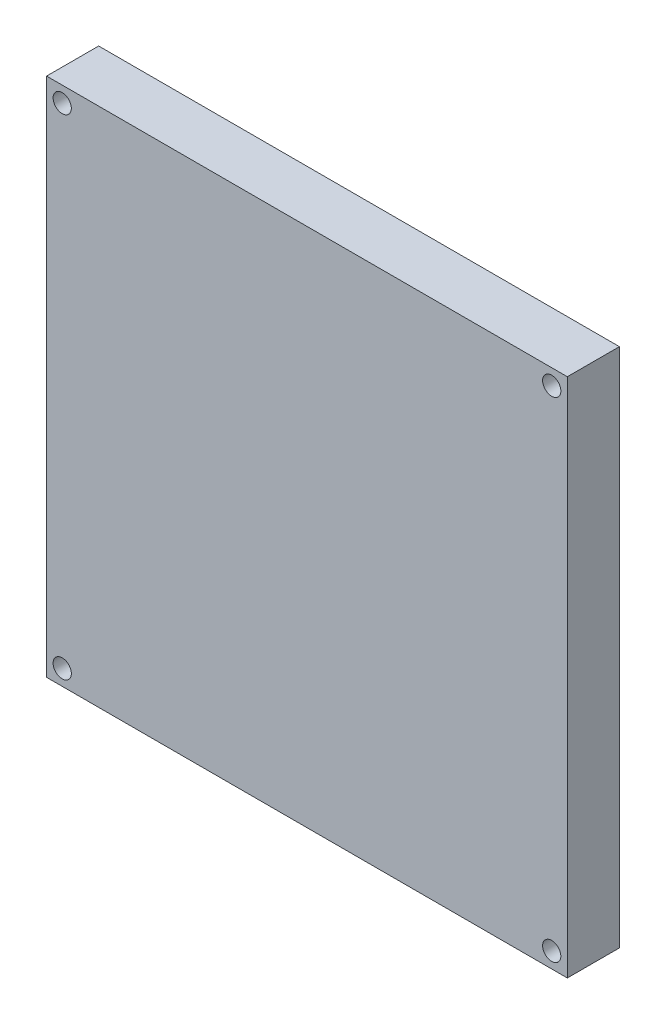
ISO-10303-21;
HEADER;
FILE_DESCRIPTION(('STEP AP214'),'2;1');
FILE_NAME('part.step','',(''),(''),'','','');
FILE_SCHEMA(('AUTOMOTIVE_DESIGN { 1 0 10303 214 1 1 1 1 }'));
ENDSEC;
DATA;
#1=APPLICATION_CONTEXT('core data for automotive mechanical design processes');
#2=APPLICATION_PROTOCOL_DEFINITION('international standard','automotive_design',2000,#1);
#3=PRODUCT_CONTEXT('',#1,'mechanical');
#4=PRODUCT('Part','Part','',(#3));
#5=PRODUCT_RELATED_PRODUCT_CATEGORY('part','',(#4));
#6=PRODUCT_DEFINITION_FORMATION('','',#4);
#7=PRODUCT_DEFINITION_CONTEXT('part definition',#1,'design');
#8=PRODUCT_DEFINITION('design','',#6,#7);
#9=PRODUCT_DEFINITION_SHAPE('','',#8);
#10=(LENGTH_UNIT() NAMED_UNIT(*) SI_UNIT(.MILLI.,.METRE.));
#11=(NAMED_UNIT(*) PLANE_ANGLE_UNIT() SI_UNIT($,.RADIAN.));
#12=(NAMED_UNIT(*) SI_UNIT($,.STERADIAN.) SOLID_ANGLE_UNIT());
#13=UNCERTAINTY_MEASURE_WITH_UNIT(LENGTH_MEASURE(1.E-05),#10,'distance_accuracy_value','');
#14=(GEOMETRIC_REPRESENTATION_CONTEXT(3) GLOBAL_UNCERTAINTY_ASSIGNED_CONTEXT((#13)) GLOBAL_UNIT_ASSIGNED_CONTEXT((#10,
#11,#12)) REPRESENTATION_CONTEXT('',''));
#15=CARTESIAN_POINT('',(0.,0.,0.));
#16=DIRECTION('',(0.,0.,1.));
#17=DIRECTION('',(1.,0.,0.));
#18=AXIS2_PLACEMENT_3D('',#15,#16,#17);
#19=CARTESIAN_POINT('',(0.,0.,10.));
#20=DIRECTION('',(1.,0.,0.));
#21=DIRECTION('',(0.,0.,-1.));
#22=AXIS2_PLACEMENT_3D('',#19,#20,#21);
#23=PLANE('',#22);
#24=DIRECTION('',(0.,-1.,0.));
#25=VECTOR('',#24,1.);
#26=CARTESIAN_POINT('',(0.,0.,0.));
#27=LINE('',#26,#25);
#28=CARTESIAN_POINT('',(0.,100.,0.));
#29=VERTEX_POINT('',#28);
#30=CARTESIAN_POINT('',(0.,0.,0.));
#31=VERTEX_POINT('',#30);
#32=EDGE_CURVE('E100',#29,#31,#27,.T.);
#33=ORIENTED_EDGE('',*,*,#32,.T.);
#34=DIRECTION('',(0.,0.,-1.));
#35=VECTOR('',#34,1.);
#36=CARTESIAN_POINT('',(0.,0.,10.));
#37=LINE('',#36,#35);
#38=CARTESIAN_POINT('',(0.,0.,10.));
#39=VERTEX_POINT('',#38);
#40=EDGE_CURVE('E11',#39,#31,#37,.T.);
#41=ORIENTED_EDGE('',*,*,#40,.F.);
#42=DIRECTION('',(0.,-1.,0.));
#43=VECTOR('',#42,1.);
#44=CARTESIAN_POINT('',(0.,0.,10.));
#45=LINE('',#44,#43);
#46=CARTESIAN_POINT('',(0.,100.,10.));
#47=VERTEX_POINT('',#46);
#48=EDGE_CURVE('E88',#47,#39,#45,.T.);
#49=ORIENTED_EDGE('',*,*,#48,.F.);
#50=DIRECTION('',(0.,0.,-1.));
#51=VECTOR('',#50,1.);
#52=CARTESIAN_POINT('',(0.,100.,10.));
#53=LINE('',#52,#51);
#54=EDGE_CURVE('E96',#47,#29,#53,.T.);
#55=ORIENTED_EDGE('',*,*,#54,.T.);
#56=EDGE_LOOP('',(#33,#41,#49,#55));
#57=FACE_BOUND('',#56,.T.);
#58=ADVANCED_FACE('F37',(#57),#23,.F.);
#59=CARTESIAN_POINT('',(0.,0.,10.));
#60=DIRECTION('',(0.,1.,0.));
#61=DIRECTION('',(0.,0.,1.));
#62=AXIS2_PLACEMENT_3D('',#59,#60,#61);
#63=PLANE('',#62);
#64=DIRECTION('',(1.,0.,0.));
#65=VECTOR('',#64,1.);
#66=CARTESIAN_POINT('',(0.,0.,0.));
#67=LINE('',#66,#65);
#68=CARTESIAN_POINT('',(100.,0.,0.));
#69=VERTEX_POINT('',#68);
#70=EDGE_CURVE('E92',#31,#69,#67,.T.);
#71=ORIENTED_EDGE('',*,*,#70,.T.);
#72=DIRECTION('',(0.,0.,-1.));
#73=VECTOR('',#72,1.);
#74=CARTESIAN_POINT('',(100.,0.,10.));
#75=LINE('',#74,#73);
#76=CARTESIAN_POINT('',(100.,0.,10.));
#77=VERTEX_POINT('',#76);
#78=EDGE_CURVE('E45',#77,#69,#75,.T.);
#79=ORIENTED_EDGE('',*,*,#78,.F.);
#80=DIRECTION('',(1.,0.,0.));
#81=VECTOR('',#80,1.);
#82=CARTESIAN_POINT('',(0.,0.,10.));
#83=LINE('',#82,#81);
#84=EDGE_CURVE('E83',#39,#77,#83,.T.);
#85=ORIENTED_EDGE('',*,*,#84,.F.);
#86=ORIENTED_EDGE('',*,*,#40,.T.);
#87=EDGE_LOOP('',(#71,#79,#85,#86));
#88=FACE_BOUND('',#87,.T.);
#89=ADVANCED_FACE('F91',(#88),#63,.F.);
#90=CARTESIAN_POINT('',(100.,0.,10.));
#91=DIRECTION('',(-1.,0.,0.));
#92=DIRECTION('',(0.,0.,1.));
#93=AXIS2_PLACEMENT_3D('',#90,#91,#92);
#94=PLANE('',#93);
#95=DIRECTION('',(0.,1.,0.));
#96=VECTOR('',#95,1.);
#97=CARTESIAN_POINT('',(100.,0.,0.));
#98=LINE('',#97,#96);
#99=CARTESIAN_POINT('',(100.,100.,0.));
#100=VERTEX_POINT('',#99);
#101=EDGE_CURVE('E70',#69,#100,#98,.T.);
#102=ORIENTED_EDGE('',*,*,#101,.T.);
#103=DIRECTION('',(0.,0.,-1.));
#104=VECTOR('',#103,1.);
#105=CARTESIAN_POINT('',(100.,100.,10.));
#106=LINE('',#105,#104);
#107=CARTESIAN_POINT('',(100.,100.,10.));
#108=VERTEX_POINT('',#107);
#109=EDGE_CURVE('E93',#108,#100,#106,.T.);
#110=ORIENTED_EDGE('',*,*,#109,.F.);
#111=DIRECTION('',(0.,1.,0.));
#112=VECTOR('',#111,1.);
#113=CARTESIAN_POINT('',(100.,0.,10.));
#114=LINE('',#113,#112);
#115=EDGE_CURVE('E86',#77,#108,#114,.T.);
#116=ORIENTED_EDGE('',*,*,#115,.F.);
#117=ORIENTED_EDGE('',*,*,#78,.T.);
#118=EDGE_LOOP('',(#102,#110,#116,#117));
#119=FACE_BOUND('',#118,.T.);
#120=ADVANCED_FACE('F94',(#119),#94,.F.);
#121=CARTESIAN_POINT('',(0.,100.,10.));
#122=DIRECTION('',(0.,-1.,0.));
#123=DIRECTION('',(0.,0.,-1.));
#124=AXIS2_PLACEMENT_3D('',#121,#122,#123);
#125=PLANE('',#124);
#126=DIRECTION('',(-1.,0.,0.));
#127=VECTOR('',#126,1.);
#128=CARTESIAN_POINT('',(0.,100.,0.));
#129=LINE('',#128,#127);
#130=EDGE_CURVE('E76',#100,#29,#129,.T.);
#131=ORIENTED_EDGE('',*,*,#130,.T.);
#132=ORIENTED_EDGE('',*,*,#54,.F.);
#133=DIRECTION('',(-1.,0.,0.));
#134=VECTOR('',#133,1.);
#135=CARTESIAN_POINT('',(0.,100.,10.));
#136=LINE('',#135,#134);
#137=EDGE_CURVE('E53',#108,#47,#136,.T.);
#138=ORIENTED_EDGE('',*,*,#137,.F.);
#139=ORIENTED_EDGE('',*,*,#109,.T.);
#140=EDGE_LOOP('',(#131,#132,#138,#139));
#141=FACE_BOUND('',#140,.T.);
#142=ADVANCED_FACE('F108',(#141),#125,.F.);
#143=CARTESIAN_POINT('',(0.,0.,10.));
#144=DIRECTION('',(0.,0.,-1.));
#145=DIRECTION('',(-1.,0.,0.));
#146=AXIS2_PLACEMENT_3D('',#143,#144,#145);
#147=PLANE('',#146);
#148=CARTESIAN_POINT('',(3.00000000000002,97.,10.));
#149=DIRECTION('',(0.,0.,1.));
#150=DIRECTION('',(-1.,0.,0.));
#151=AXIS2_PLACEMENT_3D('',#148,#149,#150);
#152=CIRCLE('',#151,1.75);
#153=CARTESIAN_POINT('',(1.25000000000002,97.,10.));
#154=VERTEX_POINT('',#153);
#155=EDGE_CURVE('E132',#154,#154,#152,.T.);
#156=ORIENTED_EDGE('',*,*,#155,.F.);
#157=EDGE_LOOP('',(#156));
#158=FACE_BOUND('',#157,.T.);
#159=CARTESIAN_POINT('',(97.,3.,10.));
#160=DIRECTION('',(0.,0.,1.));
#161=DIRECTION('',(-1.,0.,0.));
#162=AXIS2_PLACEMENT_3D('',#159,#160,#161);
#163=CIRCLE('',#162,1.75);
#164=CARTESIAN_POINT('',(95.25,3.,10.));
#165=VERTEX_POINT('',#164);
#166=EDGE_CURVE('E126',#165,#165,#163,.T.);
#167=ORIENTED_EDGE('',*,*,#166,.F.);
#168=EDGE_LOOP('',(#167));
#169=FACE_BOUND('',#168,.T.);
#170=CARTESIAN_POINT('',(3.00000000000002,3.,10.));
#171=DIRECTION('',(0.,0.,1.));
#172=DIRECTION('',(1.,0.,0.));
#173=AXIS2_PLACEMENT_3D('',#170,#171,#172);
#174=CIRCLE('',#173,1.75);
#175=CARTESIAN_POINT('',(4.75000000000001,3.,10.));
#176=VERTEX_POINT('',#175);
#177=EDGE_CURVE('E120',#176,#176,#174,.T.);
#178=ORIENTED_EDGE('',*,*,#177,.F.);
#179=EDGE_LOOP('',(#178));
#180=FACE_BOUND('',#179,.T.);
#181=CARTESIAN_POINT('',(97.,97.,10.));
#182=DIRECTION('',(0.,0.,1.));
#183=DIRECTION('',(1.,0.,0.));
#184=AXIS2_PLACEMENT_3D('',#181,#182,#183);
#185=CIRCLE('',#184,1.75);
#186=CARTESIAN_POINT('',(98.75,97.,10.));
#187=VERTEX_POINT('',#186);
#188=EDGE_CURVE('E114',#187,#187,#185,.T.);
#189=ORIENTED_EDGE('',*,*,#188,.F.);
#190=EDGE_LOOP('',(#189));
#191=FACE_BOUND('',#190,.T.);
#192=ORIENTED_EDGE('',*,*,#48,.T.);
#193=ORIENTED_EDGE('',*,*,#84,.T.);
#194=ORIENTED_EDGE('',*,*,#115,.T.);
#195=ORIENTED_EDGE('',*,*,#137,.T.);
#196=EDGE_LOOP('',(#192,#193,#194,#195));
#197=FACE_BOUND('',#196,.T.);
#198=ADVANCED_FACE('F84',(#158,#169,#180,#191,#197),#147,.F.);
#199=CARTESIAN_POINT('',(0.,0.,0.));
#200=DIRECTION('',(0.,0.,-1.));
#201=DIRECTION('',(-1.,0.,0.));
#202=AXIS2_PLACEMENT_3D('',#199,#200,#201);
#203=PLANE('',#202);
#204=CARTESIAN_POINT('',(3.00000000000002,97.,0.));
#205=DIRECTION('',(0.,0.,1.));
#206=DIRECTION('',(-1.,0.,0.));
#207=AXIS2_PLACEMENT_3D('',#204,#205,#206);
#208=CIRCLE('',#207,1.75);
#209=CARTESIAN_POINT('',(1.25000000000002,97.,0.));
#210=VERTEX_POINT('',#209);
#211=EDGE_CURVE('E117',#210,#210,#208,.T.);
#212=ORIENTED_EDGE('',*,*,#211,.T.);
#213=EDGE_LOOP('',(#212));
#214=FACE_BOUND('',#213,.T.);
#215=CARTESIAN_POINT('',(97.,3.,0.));
#216=DIRECTION('',(0.,0.,1.));
#217=DIRECTION('',(-1.,0.,0.));
#218=AXIS2_PLACEMENT_3D('',#215,#216,#217);
#219=CIRCLE('',#218,1.75);
#220=CARTESIAN_POINT('',(95.25,3.,0.));
#221=VERTEX_POINT('',#220);
#222=EDGE_CURVE('E129',#221,#221,#219,.T.);
#223=ORIENTED_EDGE('',*,*,#222,.T.);
#224=EDGE_LOOP('',(#223));
#225=FACE_BOUND('',#224,.T.);
#226=CARTESIAN_POINT('',(3.00000000000002,3.,0.));
#227=DIRECTION('',(0.,0.,1.));
#228=DIRECTION('',(1.,0.,0.));
#229=AXIS2_PLACEMENT_3D('',#226,#227,#228);
#230=CIRCLE('',#229,1.75);
#231=CARTESIAN_POINT('',(4.75000000000001,3.,0.));
#232=VERTEX_POINT('',#231);
#233=EDGE_CURVE('E123',#232,#232,#230,.T.);
#234=ORIENTED_EDGE('',*,*,#233,.T.);
#235=EDGE_LOOP('',(#234));
#236=FACE_BOUND('',#235,.T.);
#237=CARTESIAN_POINT('',(97.,97.,0.));
#238=DIRECTION('',(0.,0.,1.));
#239=DIRECTION('',(1.,0.,0.));
#240=AXIS2_PLACEMENT_3D('',#237,#238,#239);
#241=CIRCLE('',#240,1.75);
#242=CARTESIAN_POINT('',(98.75,97.,0.));
#243=VERTEX_POINT('',#242);
#244=EDGE_CURVE('E103',#243,#243,#241,.T.);
#245=ORIENTED_EDGE('',*,*,#244,.T.);
#246=EDGE_LOOP('',(#245));
#247=FACE_BOUND('',#246,.T.);
#248=ORIENTED_EDGE('',*,*,#32,.F.);
#249=ORIENTED_EDGE('',*,*,#130,.F.);
#250=ORIENTED_EDGE('',*,*,#101,.F.);
#251=ORIENTED_EDGE('',*,*,#70,.F.);
#252=EDGE_LOOP('',(#248,#249,#250,#251));
#253=FACE_BOUND('',#252,.T.);
#254=ADVANCED_FACE('F111',(#214,#225,#236,#247,#253),#203,.T.);
#255=CARTESIAN_POINT('',(97.,97.,0.));
#256=DIRECTION('',(0.,0.,1.));
#257=DIRECTION('',(1.,0.,0.));
#258=AXIS2_PLACEMENT_3D('',#255,#256,#257);
#259=CYLINDRICAL_SURFACE('',#258,1.75);
#260=ORIENTED_EDGE('',*,*,#244,.F.);
#261=EDGE_LOOP('',(#260));
#262=FACE_BOUND('',#261,.T.);
#263=ORIENTED_EDGE('',*,*,#188,.T.);
#264=EDGE_LOOP('',(#263));
#265=FACE_BOUND('',#264,.T.);
#266=ADVANCED_FACE('F156',(#262,#265),#259,.F.);
#267=CARTESIAN_POINT('',(3.00000000000002,3.,0.));
#268=DIRECTION('',(0.,0.,1.));
#269=DIRECTION('',(1.,0.,0.));
#270=AXIS2_PLACEMENT_3D('',#267,#268,#269);
#271=CYLINDRICAL_SURFACE('',#270,1.75);
#272=ORIENTED_EDGE('',*,*,#233,.F.);
#273=EDGE_LOOP('',(#272));
#274=FACE_BOUND('',#273,.T.);
#275=ORIENTED_EDGE('',*,*,#177,.T.);
#276=EDGE_LOOP('',(#275));
#277=FACE_BOUND('',#276,.T.);
#278=ADVANCED_FACE('F158',(#274,#277),#271,.F.);
#279=CARTESIAN_POINT('',(97.,3.,0.));
#280=DIRECTION('',(0.,0.,1.));
#281=DIRECTION('',(1.,0.,0.));
#282=AXIS2_PLACEMENT_3D('',#279,#280,#281);
#283=CYLINDRICAL_SURFACE('',#282,1.75);
#284=ORIENTED_EDGE('',*,*,#222,.F.);
#285=EDGE_LOOP('',(#284));
#286=FACE_BOUND('',#285,.T.);
#287=ORIENTED_EDGE('',*,*,#166,.T.);
#288=EDGE_LOOP('',(#287));
#289=FACE_BOUND('',#288,.T.);
#290=ADVANCED_FACE('F143',(#286,#289),#283,.F.);
#291=CARTESIAN_POINT('',(3.00000000000002,97.,0.));
#292=DIRECTION('',(0.,0.,1.));
#293=DIRECTION('',(1.,0.,0.));
#294=AXIS2_PLACEMENT_3D('',#291,#292,#293);
#295=CYLINDRICAL_SURFACE('',#294,1.75);
#296=ORIENTED_EDGE('',*,*,#211,.F.);
#297=EDGE_LOOP('',(#296));
#298=FACE_BOUND('',#297,.T.);
#299=ORIENTED_EDGE('',*,*,#155,.T.);
#300=EDGE_LOOP('',(#299));
#301=FACE_BOUND('',#300,.T.);
#302=ADVANCED_FACE('F140',(#298,#301),#295,.F.);
#303=CLOSED_SHELL('',(#58,#89,#120,#142,#198,#254,#266,#278,#290,#302));
#304=MANIFOLD_SOLID_BREP('B2',#303);
#305=ADVANCED_BREP_SHAPE_REPRESENTATION('',(#18,#304),#14);
#306=SHAPE_DEFINITION_REPRESENTATION(#9,#305);
ENDSEC;
END-ISO-10303-21;
